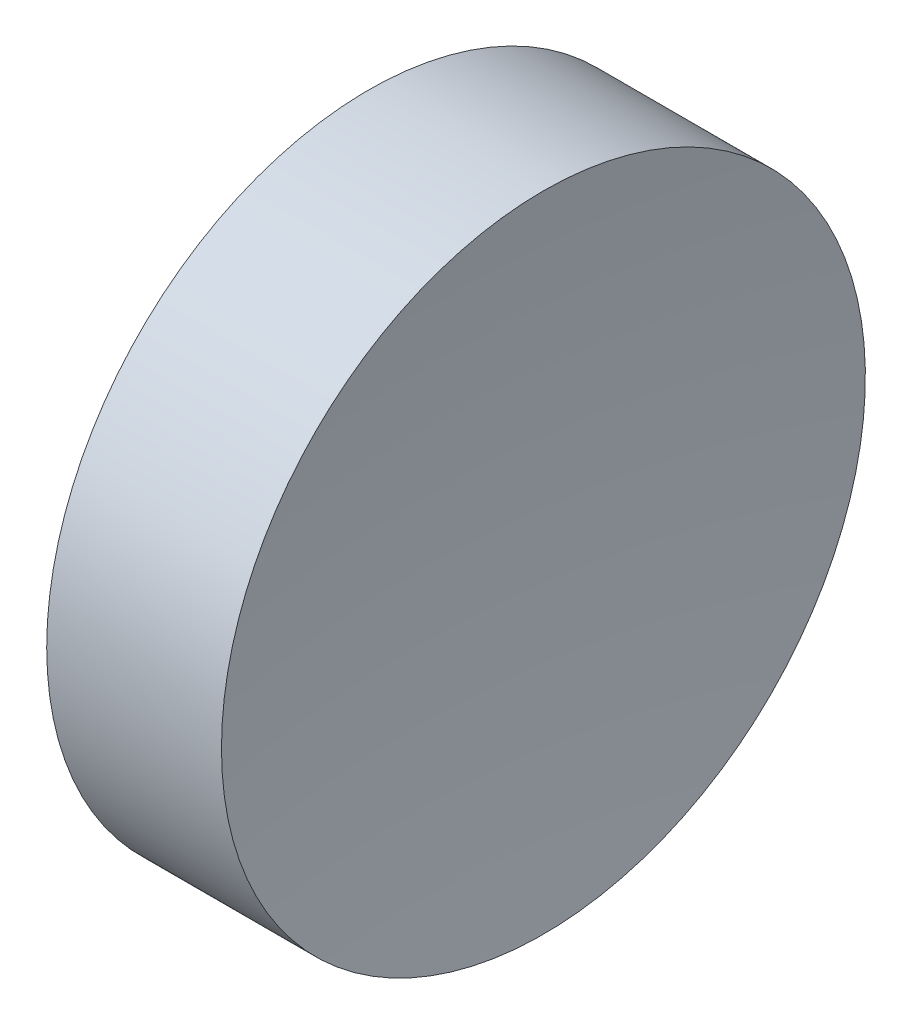
ISO-10303-21;
HEADER;
FILE_DESCRIPTION(('STEP AP214'),'2;1');
FILE_NAME('part.step','',(''),(''),'','','');
FILE_SCHEMA(('AUTOMOTIVE_DESIGN { 1 0 10303 214 1 1 1 1 }'));
ENDSEC;
DATA;
#1=APPLICATION_CONTEXT('core data for automotive mechanical design processes');
#2=APPLICATION_PROTOCOL_DEFINITION('international standard','automotive_design',2000,#1);
#3=PRODUCT_CONTEXT('',#1,'mechanical');
#4=PRODUCT('Part','Part','',(#3));
#5=PRODUCT_RELATED_PRODUCT_CATEGORY('part','',(#4));
#6=PRODUCT_DEFINITION_FORMATION('','',#4);
#7=PRODUCT_DEFINITION_CONTEXT('part definition',#1,'design');
#8=PRODUCT_DEFINITION('design','',#6,#7);
#9=PRODUCT_DEFINITION_SHAPE('','',#8);
#10=(LENGTH_UNIT() NAMED_UNIT(*) SI_UNIT(.MILLI.,.METRE.));
#11=(NAMED_UNIT(*) PLANE_ANGLE_UNIT() SI_UNIT($,.RADIAN.));
#12=(NAMED_UNIT(*) SI_UNIT($,.STERADIAN.) SOLID_ANGLE_UNIT());
#13=UNCERTAINTY_MEASURE_WITH_UNIT(LENGTH_MEASURE(1.E-05),#10,'distance_accuracy_value','');
#14=(GEOMETRIC_REPRESENTATION_CONTEXT(3) GLOBAL_UNCERTAINTY_ASSIGNED_CONTEXT((#13)) GLOBAL_UNIT_ASSIGNED_CONTEXT((#10,
#11,#12)) REPRESENTATION_CONTEXT('',''));
#15=CARTESIAN_POINT('',(0.,0.,0.));
#16=DIRECTION('',(0.,0.,1.));
#17=DIRECTION('',(1.,0.,0.));
#18=AXIS2_PLACEMENT_3D('',#15,#16,#17);
#19=CARTESIAN_POINT('',(47.4050126147231,13.0445205745975,0.));
#20=DIRECTION('',(-1.,0.,0.));
#21=DIRECTION('',(0.,1.,0.));
#22=AXIS2_PLACEMENT_3D('',#19,#20,#21);
#23=SPHERICAL_SURFACE('',#22,23.732798158944);
#24=CARTESIAN_POINT('',(23.8821894752023,13.0445205745975,0.));
#25=DIRECTION('',(-1.,0.,0.));
#26=DIRECTION('',(0.,0.,1.));
#27=AXIS2_PLACEMENT_3D('',#24,#25,#26);
#28=CIRCLE('',#27,3.15);
#29=CARTESIAN_POINT('',(23.8821894752023,13.0445205745975,3.15));
#30=VERTEX_POINT('',#29);
#31=EDGE_CURVE('E10',#30,#30,#28,.T.);
#32=ORIENTED_EDGE('',*,*,#31,.F.);
#33=EDGE_LOOP('',(#32));
#34=FACE_BOUND('',#33,.T.);
#35=ADVANCED_FACE('F35',(#34),#23,.F.);
#36=CARTESIAN_POINT('',(21.2249305570684,13.0445205745975,0.));
#37=DIRECTION('',(-1.,0.,0.));
#38=DIRECTION('',(0.,0.,1.));
#39=AXIS2_PLACEMENT_3D('',#36,#37,#38);
#40=CYLINDRICAL_SURFACE('',#39,3.15);
#41=CARTESIAN_POINT('',(22.1721894752023,13.0445205745975,0.));
#42=DIRECTION('',(-1.,0.,0.));
#43=DIRECTION('',(0.,0.,1.));
#44=AXIS2_PLACEMENT_3D('',#41,#42,#43);
#45=CIRCLE('',#44,3.15);
#46=CARTESIAN_POINT('',(22.1721894752023,13.0445205745975,3.15));
#47=VERTEX_POINT('',#46);
#48=EDGE_CURVE('E41',#47,#47,#45,.T.);
#49=ORIENTED_EDGE('',*,*,#48,.F.);
#50=EDGE_LOOP('',(#49));
#51=FACE_BOUND('',#50,.T.);
#52=ORIENTED_EDGE('',*,*,#31,.T.);
#53=EDGE_LOOP('',(#52));
#54=FACE_BOUND('',#53,.T.);
#55=ADVANCED_FACE('F49',(#51,#54),#40,.T.);
#56=CARTESIAN_POINT('',(22.1721894752023,13.0445205745975,0.));
#57=DIRECTION('',(1.,0.,0.));
#58=DIRECTION('',(0.,0.,-1.));
#59=AXIS2_PLACEMENT_3D('',#56,#57,#58);
#60=PLANE('',#59);
#61=ORIENTED_EDGE('',*,*,#48,.T.);
#62=EDGE_LOOP('',(#61));
#63=FACE_BOUND('',#62,.T.);
#64=ADVANCED_FACE('F47',(#63),#60,.F.);
#65=CLOSED_SHELL('',(#35,#55,#64));
#66=MANIFOLD_SOLID_BREP('B2',#65);
#67=ADVANCED_BREP_SHAPE_REPRESENTATION('',(#18,#66),#14);
#68=SHAPE_DEFINITION_REPRESENTATION(#9,#67);
ENDSEC;
END-ISO-10303-21;
